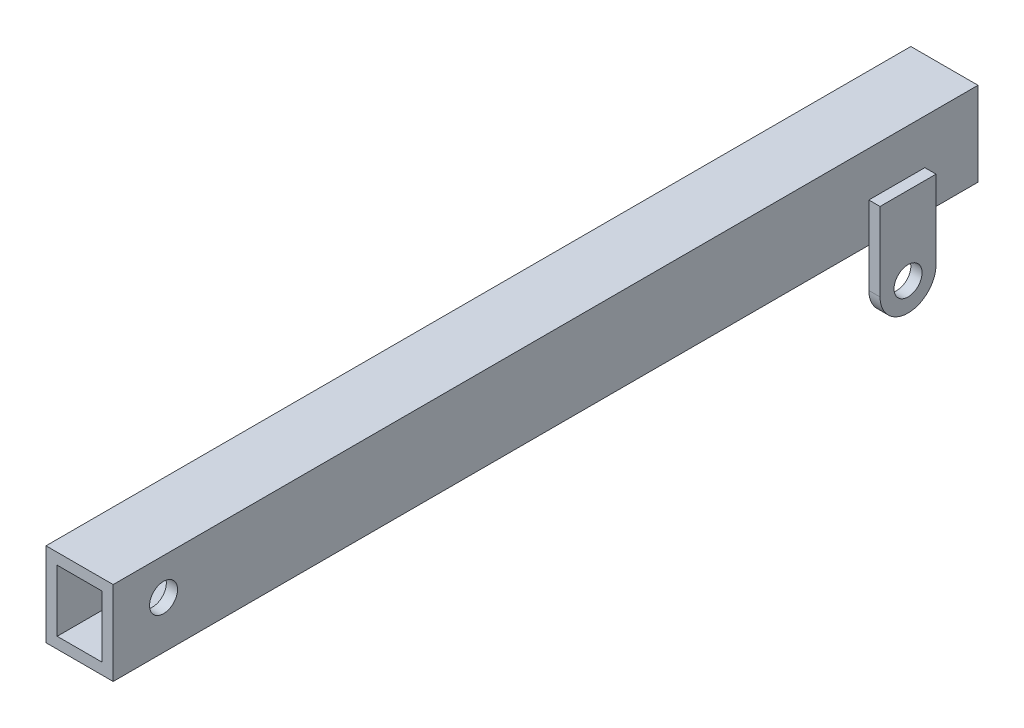
ISO-10303-21;
HEADER;
FILE_DESCRIPTION(('STEP AP214'),'2;1');
FILE_NAME('part.step','',(''),(''),'','','');
FILE_SCHEMA(('AUTOMOTIVE_DESIGN { 1 0 10303 214 1 1 1 1 }'));
ENDSEC;
DATA;
#1=APPLICATION_CONTEXT('core data for automotive mechanical design processes');
#2=APPLICATION_PROTOCOL_DEFINITION('international standard','automotive_design',2000,#1);
#3=PRODUCT_CONTEXT('',#1,'mechanical');
#4=PRODUCT('Part','Part','',(#3));
#5=PRODUCT_RELATED_PRODUCT_CATEGORY('part','',(#4));
#6=PRODUCT_DEFINITION_FORMATION('','',#4);
#7=PRODUCT_DEFINITION_CONTEXT('part definition',#1,'design');
#8=PRODUCT_DEFINITION('design','',#6,#7);
#9=PRODUCT_DEFINITION_SHAPE('','',#8);
#10=(LENGTH_UNIT() NAMED_UNIT(*) SI_UNIT(.MILLI.,.METRE.));
#11=(NAMED_UNIT(*) PLANE_ANGLE_UNIT() SI_UNIT($,.RADIAN.));
#12=(NAMED_UNIT(*) SI_UNIT($,.STERADIAN.) SOLID_ANGLE_UNIT());
#13=UNCERTAINTY_MEASURE_WITH_UNIT(LENGTH_MEASURE(1.E-05),#10,'distance_accuracy_value','');
#14=(GEOMETRIC_REPRESENTATION_CONTEXT(3) GLOBAL_UNCERTAINTY_ASSIGNED_CONTEXT((#13)) GLOBAL_UNIT_ASSIGNED_CONTEXT((#10,
#11,#12)) REPRESENTATION_CONTEXT('',''));
#15=CARTESIAN_POINT('',(0.,0.,0.));
#16=DIRECTION('',(0.,0.,1.));
#17=DIRECTION('',(1.,0.,0.));
#18=AXIS2_PLACEMENT_3D('',#15,#16,#17);
#19=CARTESIAN_POINT('',(-6.,-7.5,159.5));
#20=DIRECTION('',(1.,0.,0.));
#21=DIRECTION('',(0.,0.,-1.));
#22=AXIS2_PLACEMENT_3D('',#19,#20,#21);
#23=PLANE('',#22);
#24=CARTESIAN_POINT('',(-6.,0.999999999999758,-9.0000000000012));
#25=DIRECTION('',(-1.,0.,0.));
#26=DIRECTION('',(0.,0.,1.));
#27=AXIS2_PLACEMENT_3D('',#24,#25,#26);
#28=CIRCLE('',#27,2.5);
#29=CARTESIAN_POINT('',(-6.,0.999999999999758,-6.5000000000012));
#30=VERTEX_POINT('',#29);
#31=EDGE_CURVE('E198',#30,#30,#28,.T.);
#32=ORIENTED_EDGE('',*,*,#31,.F.);
#33=EDGE_LOOP('',(#32));
#34=FACE_BOUND('',#33,.T.);
#35=DIRECTION('',(0.,0.,-1.));
#36=VECTOR('',#35,1.);
#37=CARTESIAN_POINT('',(-6.,7.5,159.5));
#38=LINE('',#37,#36);
#39=CARTESIAN_POINT('',(-6.,7.5,0.));
#40=VERTEX_POINT('',#39);
#41=CARTESIAN_POINT('',(-6.,7.5,-154.5));
#42=VERTEX_POINT('',#41);
#43=EDGE_CURVE('E186',#40,#42,#38,.T.);
#44=ORIENTED_EDGE('',*,*,#43,.T.);
#45=DIRECTION('',(0.,-1.,0.));
#46=VECTOR('',#45,1.);
#47=CARTESIAN_POINT('',(-6.,-7.5,-154.5));
#48=LINE('',#47,#46);
#49=CARTESIAN_POINT('',(-6.,-7.5,-154.5));
#50=VERTEX_POINT('',#49);
#51=EDGE_CURVE('E164',#42,#50,#48,.T.);
#52=ORIENTED_EDGE('',*,*,#51,.T.);
#53=DIRECTION('',(0.,0.,-1.));
#54=VECTOR('',#53,1.);
#55=CARTESIAN_POINT('',(-6.,-7.5,159.5));
#56=LINE('',#55,#54);
#57=CARTESIAN_POINT('',(-6.,-7.5,-145.));
#58=VERTEX_POINT('',#57);
#59=EDGE_CURVE('E363',#58,#50,#56,.T.);
#60=ORIENTED_EDGE('',*,*,#59,.F.);
#61=DIRECTION('',(0.,-1.,0.));
#62=VECTOR('',#61,1.);
#63=CARTESIAN_POINT('',(-6.,-14.5,-145.));
#64=LINE('',#63,#62);
#65=CARTESIAN_POINT('',(-6.,-0.500000000000001,-145.));
#66=VERTEX_POINT('',#65);
#67=EDGE_CURVE('E325',#66,#58,#64,.T.);
#68=ORIENTED_EDGE('',*,*,#67,.F.);
#69=DIRECTION('',(0.,0.,-1.));
#70=VECTOR('',#69,1.);
#71=CARTESIAN_POINT('',(-6.,-0.500000000000001,-145.));
#72=LINE('',#71,#70);
#73=CARTESIAN_POINT('',(-6.,-0.500000000000001,-135.));
#74=VERTEX_POINT('',#73);
#75=EDGE_CURVE('E321',#74,#66,#72,.T.);
#76=ORIENTED_EDGE('',*,*,#75,.F.);
#77=DIRECTION('',(0.,1.,0.));
#78=VECTOR('',#77,1.);
#79=CARTESIAN_POINT('',(-6.,-14.5,-135.));
#80=LINE('',#79,#78);
#81=CARTESIAN_POINT('',(-6.,-7.5,-135.));
#82=VERTEX_POINT('',#81);
#83=EDGE_CURVE('E298',#82,#74,#80,.T.);
#84=ORIENTED_EDGE('',*,*,#83,.F.);
#85=CARTESIAN_POINT('',(-6.,-7.5,0.));
#86=VERTEX_POINT('',#85);
#87=EDGE_CURVE('E191',#86,#82,#56,.T.);
#88=ORIENTED_EDGE('',*,*,#87,.F.);
#89=DIRECTION('',(0.,1.,0.));
#90=VECTOR('',#89,1.);
#91=CARTESIAN_POINT('',(-6.,-7.5,0.));
#92=LINE('',#91,#90);
#93=EDGE_CURVE('E234',#86,#40,#92,.T.);
#94=ORIENTED_EDGE('',*,*,#93,.T.);
#95=EDGE_LOOP('',(#44,#52,#60,#68,#76,#84,#88,#94));
#96=FACE_BOUND('',#95,.T.);
#97=ADVANCED_FACE('F38',(#34,#96),#23,.F.);
#98=CARTESIAN_POINT('',(6.,-7.5,159.5));
#99=DIRECTION('',(-1.,0.,0.));
#100=DIRECTION('',(0.,0.,1.));
#101=AXIS2_PLACEMENT_3D('',#98,#99,#100);
#102=PLANE('',#101);
#103=CARTESIAN_POINT('',(6.,0.999999999999758,-9.0000000000012));
#104=DIRECTION('',(-1.,0.,0.));
#105=DIRECTION('',(0.,0.,1.));
#106=AXIS2_PLACEMENT_3D('',#103,#104,#105);
#107=CIRCLE('',#106,2.5);
#108=CARTESIAN_POINT('',(6.,0.999999999999758,-6.5000000000012));
#109=VERTEX_POINT('',#108);
#110=EDGE_CURVE('E204',#109,#109,#107,.T.);
#111=ORIENTED_EDGE('',*,*,#110,.T.);
#112=EDGE_LOOP('',(#111));
#113=FACE_BOUND('',#112,.T.);
#114=DIRECTION('',(0.,0.,-1.));
#115=VECTOR('',#114,1.);
#116=CARTESIAN_POINT('',(6.,-7.5,159.5));
#117=LINE('',#116,#115);
#118=CARTESIAN_POINT('',(6.,-7.5,-145.));
#119=VERTEX_POINT('',#118);
#120=CARTESIAN_POINT('',(6.,-7.5,-154.5));
#121=VERTEX_POINT('',#120);
#122=EDGE_CURVE('E178',#119,#121,#117,.T.);
#123=ORIENTED_EDGE('',*,*,#122,.T.);
#124=DIRECTION('',(0.,1.,0.));
#125=VECTOR('',#124,1.);
#126=CARTESIAN_POINT('',(6.,-7.5,-154.5));
#127=LINE('',#126,#125);
#128=CARTESIAN_POINT('',(6.,7.5,-154.5));
#129=VERTEX_POINT('',#128);
#130=EDGE_CURVE('E54',#121,#129,#127,.T.);
#131=ORIENTED_EDGE('',*,*,#130,.T.);
#132=DIRECTION('',(0.,0.,-1.));
#133=VECTOR('',#132,1.);
#134=CARTESIAN_POINT('',(6.,7.5,159.5));
#135=LINE('',#134,#133);
#136=CARTESIAN_POINT('',(6.,7.5,0.));
#137=VERTEX_POINT('',#136);
#138=EDGE_CURVE('E176',#137,#129,#135,.T.);
#139=ORIENTED_EDGE('',*,*,#138,.F.);
#140=DIRECTION('',(0.,-1.,0.));
#141=VECTOR('',#140,1.);
#142=CARTESIAN_POINT('',(6.,-7.5,0.));
#143=LINE('',#142,#141);
#144=CARTESIAN_POINT('',(6.,-7.5,0.));
#145=VERTEX_POINT('',#144);
#146=EDGE_CURVE('E231',#137,#145,#143,.T.);
#147=ORIENTED_EDGE('',*,*,#146,.T.);
#148=CARTESIAN_POINT('',(6.,-7.5,-135.));
#149=VERTEX_POINT('',#148);
#150=EDGE_CURVE('E361',#145,#149,#117,.T.);
#151=ORIENTED_EDGE('',*,*,#150,.T.);
#152=DIRECTION('',(0.,1.,0.));
#153=VECTOR('',#152,1.);
#154=CARTESIAN_POINT('',(6.,-14.5,-135.));
#155=LINE('',#154,#153);
#156=CARTESIAN_POINT('',(6.,-0.5,-135.));
#157=VERTEX_POINT('',#156);
#158=EDGE_CURVE('E243',#149,#157,#155,.T.);
#159=ORIENTED_EDGE('',*,*,#158,.T.);
#160=DIRECTION('',(0.,0.,-1.));
#161=VECTOR('',#160,1.);
#162=CARTESIAN_POINT('',(6.,-0.500000000000001,-145.));
#163=LINE('',#162,#161);
#164=CARTESIAN_POINT('',(6.,-0.5,-145.));
#165=VERTEX_POINT('',#164);
#166=EDGE_CURVE('E252',#157,#165,#163,.T.);
#167=ORIENTED_EDGE('',*,*,#166,.T.);
#168=DIRECTION('',(0.,-1.,0.));
#169=VECTOR('',#168,1.);
#170=CARTESIAN_POINT('',(6.,-14.5,-145.));
#171=LINE('',#170,#169);
#172=EDGE_CURVE('E274',#165,#119,#171,.T.);
#173=ORIENTED_EDGE('',*,*,#172,.T.);
#174=EDGE_LOOP('',(#123,#131,#139,#147,#151,#159,#167,#173));
#175=FACE_BOUND('',#174,.T.);
#176=ADVANCED_FACE('F40',(#113,#175),#102,.F.);
#177=CARTESIAN_POINT('',(-6.,7.5,159.5));
#178=DIRECTION('',(0.,-1.,0.));
#179=DIRECTION('',(0.,0.,-1.));
#180=AXIS2_PLACEMENT_3D('',#177,#178,#179);
#181=PLANE('',#180);
#182=ORIENTED_EDGE('',*,*,#138,.T.);
#183=DIRECTION('',(-1.,0.,0.));
#184=VECTOR('',#183,1.);
#185=CARTESIAN_POINT('',(8.,7.5,-154.5));
#186=LINE('',#185,#184);
#187=EDGE_CURVE('E161',#129,#42,#186,.T.);
#188=ORIENTED_EDGE('',*,*,#187,.T.);
#189=ORIENTED_EDGE('',*,*,#43,.F.);
#190=DIRECTION('',(1.,0.,0.));
#191=VECTOR('',#190,1.);
#192=CARTESIAN_POINT('',(-8.,7.5,0.));
#193=LINE('',#192,#191);
#194=EDGE_CURVE('E184',#40,#137,#193,.T.);
#195=ORIENTED_EDGE('',*,*,#194,.T.);
#196=EDGE_LOOP('',(#182,#188,#189,#195));
#197=FACE_BOUND('',#196,.T.);
#198=ADVANCED_FACE('F183',(#197),#181,.F.);
#199=CARTESIAN_POINT('',(-6.,-7.5,159.5));
#200=DIRECTION('',(0.,1.,0.));
#201=DIRECTION('',(0.,0.,1.));
#202=AXIS2_PLACEMENT_3D('',#199,#200,#201);
#203=PLANE('',#202);
#204=ORIENTED_EDGE('',*,*,#59,.T.);
#205=DIRECTION('',(-1.,0.,0.));
#206=VECTOR('',#205,1.);
#207=CARTESIAN_POINT('',(8.,-7.5,-154.5));
#208=LINE('',#207,#206);
#209=EDGE_CURVE('E170',#121,#50,#208,.T.);
#210=ORIENTED_EDGE('',*,*,#209,.F.);
#211=ORIENTED_EDGE('',*,*,#122,.F.);
#212=EDGE_CURVE('E364',#149,#119,#117,.T.);
#213=ORIENTED_EDGE('',*,*,#212,.F.);
#214=ORIENTED_EDGE('',*,*,#150,.F.);
#215=DIRECTION('',(-1.,0.,0.));
#216=VECTOR('',#215,1.);
#217=CARTESIAN_POINT('',(-6.,-7.5,0.));
#218=LINE('',#217,#216);
#219=EDGE_CURVE('E227',#145,#86,#218,.T.);
#220=ORIENTED_EDGE('',*,*,#219,.T.);
#221=ORIENTED_EDGE('',*,*,#87,.T.);
#222=EDGE_CURVE('E366',#82,#58,#56,.T.);
#223=ORIENTED_EDGE('',*,*,#222,.T.);
#224=EDGE_LOOP('',(#204,#210,#211,#213,#214,#220,#221,#223));
#225=FACE_BOUND('',#224,.T.);
#226=ADVANCED_FACE('F375',(#225),#203,.F.);
#227=CARTESIAN_POINT('',(4.,-5.5,159.5));
#228=DIRECTION('',(-1.,0.,0.));
#229=DIRECTION('',(0.,0.,1.));
#230=AXIS2_PLACEMENT_3D('',#227,#228,#229);
#231=PLANE('',#230);
#232=DIRECTION('',(0.,1.,0.));
#233=VECTOR('',#232,1.);
#234=CARTESIAN_POINT('',(4.,-5.5,-154.5));
#235=LINE('',#234,#233);
#236=CARTESIAN_POINT('',(4.,-5.5,-154.5));
#237=VERTEX_POINT('',#236);
#238=CARTESIAN_POINT('',(4.,5.5,-154.5));
#239=VERTEX_POINT('',#238);
#240=EDGE_CURVE('E180',#237,#239,#235,.T.);
#241=ORIENTED_EDGE('',*,*,#240,.F.);
#242=DIRECTION('',(0.,0.,-1.));
#243=VECTOR('',#242,1.);
#244=CARTESIAN_POINT('',(4.,-5.5,159.5));
#245=LINE('',#244,#243);
#246=CARTESIAN_POINT('',(4.,-5.5,0.));
#247=VERTEX_POINT('',#246);
#248=EDGE_CURVE('E345',#247,#237,#245,.T.);
#249=ORIENTED_EDGE('',*,*,#248,.F.);
#250=DIRECTION('',(0.,-1.,0.));
#251=VECTOR('',#250,1.);
#252=CARTESIAN_POINT('',(4.,-5.5,0.));
#253=LINE('',#252,#251);
#254=CARTESIAN_POINT('',(4.,5.5,0.));
#255=VERTEX_POINT('',#254);
#256=EDGE_CURVE('E224',#255,#247,#253,.T.);
#257=ORIENTED_EDGE('',*,*,#256,.F.);
#258=DIRECTION('',(0.,0.,-1.));
#259=VECTOR('',#258,1.);
#260=CARTESIAN_POINT('',(4.,5.5,159.5));
#261=LINE('',#260,#259);
#262=EDGE_CURVE('E357',#255,#239,#261,.T.);
#263=ORIENTED_EDGE('',*,*,#262,.T.);
#264=EDGE_LOOP('',(#241,#249,#257,#263));
#265=FACE_BOUND('',#264,.T.);
#266=CARTESIAN_POINT('',(4.,0.999999999999758,-9.0000000000012));
#267=DIRECTION('',(-1.,0.,0.));
#268=DIRECTION('',(0.,0.,1.));
#269=AXIS2_PLACEMENT_3D('',#266,#267,#268);
#270=CIRCLE('',#269,2.5);
#271=CARTESIAN_POINT('',(4.,0.999999999999758,-6.5000000000012));
#272=VERTEX_POINT('',#271);
#273=EDGE_CURVE('E197',#272,#272,#270,.T.);
#274=ORIENTED_EDGE('',*,*,#273,.F.);
#275=EDGE_LOOP('',(#274));
#276=FACE_BOUND('',#275,.T.);
#277=ADVANCED_FACE('F455',(#265,#276),#231,.T.);
#278=CARTESIAN_POINT('',(-4.,5.5,159.5));
#279=DIRECTION('',(0.,-1.,0.));
#280=DIRECTION('',(0.,0.,-1.));
#281=AXIS2_PLACEMENT_3D('',#278,#279,#280);
#282=PLANE('',#281);
#283=DIRECTION('',(-1.,0.,0.));
#284=VECTOR('',#283,1.);
#285=CARTESIAN_POINT('',(-4.,5.5,-154.5));
#286=LINE('',#285,#284);
#287=CARTESIAN_POINT('',(-4.,5.5,-154.5));
#288=VERTEX_POINT('',#287);
#289=EDGE_CURVE('E664',#239,#288,#286,.T.);
#290=ORIENTED_EDGE('',*,*,#289,.F.);
#291=ORIENTED_EDGE('',*,*,#262,.F.);
#292=DIRECTION('',(1.,0.,0.));
#293=VECTOR('',#292,1.);
#294=CARTESIAN_POINT('',(-4.,5.5,0.));
#295=LINE('',#294,#293);
#296=CARTESIAN_POINT('',(-4.,5.5,0.));
#297=VERTEX_POINT('',#296);
#298=EDGE_CURVE('E221',#297,#255,#295,.T.);
#299=ORIENTED_EDGE('',*,*,#298,.F.);
#300=DIRECTION('',(0.,0.,-1.));
#301=VECTOR('',#300,1.);
#302=CARTESIAN_POINT('',(-4.,5.5,159.5));
#303=LINE('',#302,#301);
#304=EDGE_CURVE('E353',#297,#288,#303,.T.);
#305=ORIENTED_EDGE('',*,*,#304,.T.);
#306=EDGE_LOOP('',(#290,#291,#299,#305));
#307=FACE_BOUND('',#306,.T.);
#308=ADVANCED_FACE('F459',(#307),#282,.T.);
#309=CARTESIAN_POINT('',(-4.,-5.5,159.5));
#310=DIRECTION('',(1.,0.,0.));
#311=DIRECTION('',(0.,0.,-1.));
#312=AXIS2_PLACEMENT_3D('',#309,#310,#311);
#313=PLANE('',#312);
#314=DIRECTION('',(0.,-1.,0.));
#315=VECTOR('',#314,1.);
#316=CARTESIAN_POINT('',(-4.,-5.5,-154.5));
#317=LINE('',#316,#315);
#318=CARTESIAN_POINT('',(-4.,-5.5,-154.5));
#319=VERTEX_POINT('',#318);
#320=EDGE_CURVE('E61',#288,#319,#317,.T.);
#321=ORIENTED_EDGE('',*,*,#320,.F.);
#322=ORIENTED_EDGE('',*,*,#304,.F.);
#323=DIRECTION('',(0.,1.,0.));
#324=VECTOR('',#323,1.);
#325=CARTESIAN_POINT('',(-4.,-5.5,0.));
#326=LINE('',#325,#324);
#327=CARTESIAN_POINT('',(-4.,-5.5,0.));
#328=VERTEX_POINT('',#327);
#329=EDGE_CURVE('E218',#328,#297,#326,.T.);
#330=ORIENTED_EDGE('',*,*,#329,.F.);
#331=DIRECTION('',(0.,0.,-1.));
#332=VECTOR('',#331,1.);
#333=CARTESIAN_POINT('',(-4.,-5.5,159.5));
#334=LINE('',#333,#332);
#335=EDGE_CURVE('E349',#328,#319,#334,.T.);
#336=ORIENTED_EDGE('',*,*,#335,.T.);
#337=EDGE_LOOP('',(#321,#322,#330,#336));
#338=FACE_BOUND('',#337,.T.);
#339=CARTESIAN_POINT('',(-4.,0.999999999999758,-9.0000000000012));
#340=DIRECTION('',(1.,0.,0.));
#341=DIRECTION('',(0.,0.,-1.));
#342=AXIS2_PLACEMENT_3D('',#339,#340,#341);
#343=CIRCLE('',#342,2.5);
#344=CARTESIAN_POINT('',(-4.,0.999999999999758,-11.5000000000012));
#345=VERTEX_POINT('',#344);
#346=EDGE_CURVE('E194',#345,#345,#343,.T.);
#347=ORIENTED_EDGE('',*,*,#346,.F.);
#348=EDGE_LOOP('',(#347));
#349=FACE_BOUND('',#348,.T.);
#350=ADVANCED_FACE('F464',(#338,#349),#313,.T.);
#351=CARTESIAN_POINT('',(-4.,-5.5,159.5));
#352=DIRECTION('',(0.,1.,0.));
#353=DIRECTION('',(0.,0.,1.));
#354=AXIS2_PLACEMENT_3D('',#351,#352,#353);
#355=PLANE('',#354);
#356=DIRECTION('',(1.,0.,0.));
#357=VECTOR('',#356,1.);
#358=CARTESIAN_POINT('',(-4.,-5.5,-154.5));
#359=LINE('',#358,#357);
#360=EDGE_CURVE('E11',#319,#237,#359,.T.);
#361=ORIENTED_EDGE('',*,*,#360,.F.);
#362=ORIENTED_EDGE('',*,*,#335,.F.);
#363=DIRECTION('',(-1.,0.,0.));
#364=VECTOR('',#363,1.);
#365=CARTESIAN_POINT('',(-4.,-5.5,0.));
#366=LINE('',#365,#364);
#367=EDGE_CURVE('E47',#247,#328,#366,.T.);
#368=ORIENTED_EDGE('',*,*,#367,.F.);
#369=ORIENTED_EDGE('',*,*,#248,.T.);
#370=EDGE_LOOP('',(#361,#362,#368,#369));
#371=FACE_BOUND('',#370,.T.);
#372=ADVANCED_FACE('F472',(#371),#355,.T.);
#373=CARTESIAN_POINT('',(-6.,-14.5,-140.));
#374=DIRECTION('',(-1.,0.,0.));
#375=DIRECTION('',(0.,0.,1.));
#376=AXIS2_PLACEMENT_3D('',#373,#374,#375);
#377=PLANE('',#376);
#378=CARTESIAN_POINT('',(-6.,-14.5,-140.));
#379=DIRECTION('',(-1.,0.,0.));
#380=DIRECTION('',(0.,0.,1.));
#381=AXIS2_PLACEMENT_3D('',#378,#379,#380);
#382=CIRCLE('',#381,2.5);
#383=CARTESIAN_POINT('',(-6.,-14.5,-137.5));
#384=VERTEX_POINT('',#383);
#385=EDGE_CURVE('E293',#384,#384,#382,.T.);
#386=ORIENTED_EDGE('',*,*,#385,.T.);
#387=EDGE_LOOP('',(#386));
#388=FACE_BOUND('',#387,.T.);
#389=CARTESIAN_POINT('',(-6.,-14.5,-145.));
#390=VERTEX_POINT('',#389);
#391=EDGE_CURVE('E324',#58,#390,#64,.T.);
#392=ORIENTED_EDGE('',*,*,#391,.F.);
#393=ORIENTED_EDGE('',*,*,#222,.F.);
#394=CARTESIAN_POINT('',(-6.,-14.5,-135.));
#395=VERTEX_POINT('',#394);
#396=EDGE_CURVE('E317',#395,#82,#80,.T.);
#397=ORIENTED_EDGE('',*,*,#396,.F.);
#398=CARTESIAN_POINT('',(-6.,-14.5,-140.));
#399=DIRECTION('',(-1.,0.,0.));
#400=DIRECTION('',(0.,0.,1.));
#401=AXIS2_PLACEMENT_3D('',#398,#399,#400);
#402=CIRCLE('',#401,5.);
#403=EDGE_CURVE('E307',#390,#395,#402,.T.);
#404=ORIENTED_EDGE('',*,*,#403,.F.);
#405=EDGE_LOOP('',(#392,#393,#397,#404));
#406=FACE_BOUND('',#405,.T.);
#407=ADVANCED_FACE('F425',(#388,#406),#377,.F.);
#408=CARTESIAN_POINT('',(-8.,-14.5,-140.));
#409=DIRECTION('',(-1.,0.,0.));
#410=DIRECTION('',(0.,0.,1.));
#411=AXIS2_PLACEMENT_3D('',#408,#409,#410);
#412=PLANE('',#411);
#413=DIRECTION('',(0.,1.,0.));
#414=VECTOR('',#413,1.);
#415=CARTESIAN_POINT('',(-8.,-14.5,-135.));
#416=LINE('',#415,#414);
#417=CARTESIAN_POINT('',(-8.,-14.5,-135.));
#418=VERTEX_POINT('',#417);
#419=CARTESIAN_POINT('',(-8.,-0.500000000000001,-135.));
#420=VERTEX_POINT('',#419);
#421=EDGE_CURVE('E302',#418,#420,#416,.T.);
#422=ORIENTED_EDGE('',*,*,#421,.T.);
#423=DIRECTION('',(0.,0.,-1.));
#424=VECTOR('',#423,1.);
#425=CARTESIAN_POINT('',(-8.,-0.500000000000001,-145.));
#426=LINE('',#425,#424);
#427=CARTESIAN_POINT('',(-8.,-0.500000000000001,-145.));
#428=VERTEX_POINT('',#427);
#429=EDGE_CURVE('E306',#420,#428,#426,.T.);
#430=ORIENTED_EDGE('',*,*,#429,.T.);
#431=DIRECTION('',(0.,-1.,0.));
#432=VECTOR('',#431,1.);
#433=CARTESIAN_POINT('',(-8.,-14.5,-145.));
#434=LINE('',#433,#432);
#435=CARTESIAN_POINT('',(-8.,-14.5,-145.));
#436=VERTEX_POINT('',#435);
#437=EDGE_CURVE('E310',#428,#436,#434,.T.);
#438=ORIENTED_EDGE('',*,*,#437,.T.);
#439=CARTESIAN_POINT('',(-8.,-14.5,-140.));
#440=DIRECTION('',(-1.,0.,0.));
#441=DIRECTION('',(0.,0.,1.));
#442=AXIS2_PLACEMENT_3D('',#439,#440,#441);
#443=CIRCLE('',#442,5.);
#444=EDGE_CURVE('E313',#436,#418,#443,.T.);
#445=ORIENTED_EDGE('',*,*,#444,.T.);
#446=EDGE_LOOP('',(#422,#430,#438,#445));
#447=FACE_BOUND('',#446,.T.);
#448=CARTESIAN_POINT('',(-8.,-14.5,-140.));
#449=DIRECTION('',(-1.,0.,0.));
#450=DIRECTION('',(0.,0.,1.));
#451=AXIS2_PLACEMENT_3D('',#448,#449,#450);
#452=CIRCLE('',#451,2.5);
#453=CARTESIAN_POINT('',(-8.,-14.5,-137.5));
#454=VERTEX_POINT('',#453);
#455=EDGE_CURVE('E294',#454,#454,#452,.T.);
#456=ORIENTED_EDGE('',*,*,#455,.F.);
#457=EDGE_LOOP('',(#456));
#458=FACE_BOUND('',#457,.T.);
#459=ADVANCED_FACE('F417',(#447,#458),#412,.T.);
#460=CARTESIAN_POINT('',(-8.,-14.5,-135.));
#461=DIRECTION('',(0.,0.,-1.));
#462=DIRECTION('',(-1.,0.,0.));
#463=AXIS2_PLACEMENT_3D('',#460,#461,#462);
#464=PLANE('',#463);
#465=ORIENTED_EDGE('',*,*,#396,.T.);
#466=ORIENTED_EDGE('',*,*,#83,.T.);
#467=DIRECTION('',(1.,0.,0.));
#468=VECTOR('',#467,1.);
#469=CARTESIAN_POINT('',(-8.,-0.500000000000001,-135.));
#470=LINE('',#469,#468);
#471=EDGE_CURVE('E341',#420,#74,#470,.T.);
#472=ORIENTED_EDGE('',*,*,#471,.F.);
#473=ORIENTED_EDGE('',*,*,#421,.F.);
#474=DIRECTION('',(1.,0.,0.));
#475=VECTOR('',#474,1.);
#476=CARTESIAN_POINT('',(-8.,-14.5,-135.));
#477=LINE('',#476,#475);
#478=EDGE_CURVE('E316',#418,#395,#477,.T.);
#479=ORIENTED_EDGE('',*,*,#478,.T.);
#480=EDGE_LOOP('',(#465,#466,#472,#473,#479));
#481=FACE_BOUND('',#480,.T.);
#482=ADVANCED_FACE('F409',(#481),#464,.F.);
#483=CARTESIAN_POINT('',(-8.,-0.500000000000001,-145.));
#484=DIRECTION('',(0.,-1.,0.));
#485=DIRECTION('',(0.,0.,-1.));
#486=AXIS2_PLACEMENT_3D('',#483,#484,#485);
#487=PLANE('',#486);
#488=ORIENTED_EDGE('',*,*,#75,.T.);
#489=DIRECTION('',(1.,0.,0.));
#490=VECTOR('',#489,1.);
#491=CARTESIAN_POINT('',(-8.,-0.500000000000001,-145.));
#492=LINE('',#491,#490);
#493=EDGE_CURVE('E337',#428,#66,#492,.T.);
#494=ORIENTED_EDGE('',*,*,#493,.F.);
#495=ORIENTED_EDGE('',*,*,#429,.F.);
#496=ORIENTED_EDGE('',*,*,#471,.T.);
#497=EDGE_LOOP('',(#488,#494,#495,#496));
#498=FACE_BOUND('',#497,.T.);
#499=ADVANCED_FACE('F413',(#498),#487,.F.);
#500=CARTESIAN_POINT('',(-8.,-14.5,-145.));
#501=DIRECTION('',(0.,0.,1.));
#502=DIRECTION('',(1.,0.,0.));
#503=AXIS2_PLACEMENT_3D('',#500,#501,#502);
#504=PLANE('',#503);
#505=ORIENTED_EDGE('',*,*,#67,.T.);
#506=ORIENTED_EDGE('',*,*,#391,.T.);
#507=DIRECTION('',(1.,0.,0.));
#508=VECTOR('',#507,1.);
#509=CARTESIAN_POINT('',(-8.,-14.5,-145.));
#510=LINE('',#509,#508);
#511=EDGE_CURVE('E333',#436,#390,#510,.T.);
#512=ORIENTED_EDGE('',*,*,#511,.F.);
#513=ORIENTED_EDGE('',*,*,#437,.F.);
#514=ORIENTED_EDGE('',*,*,#493,.T.);
#515=EDGE_LOOP('',(#505,#506,#512,#513,#514));
#516=FACE_BOUND('',#515,.T.);
#517=ADVANCED_FACE('F428',(#516),#504,.F.);
#518=CARTESIAN_POINT('',(-8.,-14.5,-140.));
#519=DIRECTION('',(1.,0.,0.));
#520=DIRECTION('',(0.,0.,-1.));
#521=AXIS2_PLACEMENT_3D('',#518,#519,#520);
#522=CYLINDRICAL_SURFACE('',#521,5.);
#523=ORIENTED_EDGE('',*,*,#403,.T.);
#524=ORIENTED_EDGE('',*,*,#478,.F.);
#525=ORIENTED_EDGE('',*,*,#444,.F.);
#526=ORIENTED_EDGE('',*,*,#511,.T.);
#527=EDGE_LOOP('',(#523,#524,#525,#526));
#528=FACE_BOUND('',#527,.T.);
#529=ADVANCED_FACE('F429',(#528),#522,.T.);
#530=CARTESIAN_POINT('',(-8.,-14.5,-140.));
#531=DIRECTION('',(1.,0.,0.));
#532=DIRECTION('',(0.,0.,-1.));
#533=AXIS2_PLACEMENT_3D('',#530,#531,#532);
#534=CYLINDRICAL_SURFACE('',#533,2.5);
#535=ORIENTED_EDGE('',*,*,#455,.T.);
#536=EDGE_LOOP('',(#535));
#537=FACE_BOUND('',#536,.T.);
#538=ORIENTED_EDGE('',*,*,#385,.F.);
#539=EDGE_LOOP('',(#538));
#540=FACE_BOUND('',#539,.T.);
#541=ADVANCED_FACE('F431',(#537,#540),#534,.F.);
#542=CARTESIAN_POINT('',(6.,-14.5,-140.));
#543=DIRECTION('',(1.,0.,0.));
#544=DIRECTION('',(0.,0.,1.));
#545=AXIS2_PLACEMENT_3D('',#542,#543,#544);
#546=PLANE('',#545);
#547=CARTESIAN_POINT('',(6.,-14.5,-140.));
#548=DIRECTION('',(-1.,0.,0.));
#549=DIRECTION('',(0.,0.,1.));
#550=AXIS2_PLACEMENT_3D('',#547,#548,#549);
#551=CIRCLE('',#550,2.5);
#552=CARTESIAN_POINT('',(6.,-14.5,-137.5));
#553=VERTEX_POINT('',#552);
#554=EDGE_CURVE('E238',#553,#553,#551,.T.);
#555=ORIENTED_EDGE('',*,*,#554,.F.);
#556=EDGE_LOOP('',(#555));
#557=FACE_BOUND('',#556,.T.);
#558=CARTESIAN_POINT('',(6.,-14.5,-135.));
#559=VERTEX_POINT('',#558);
#560=EDGE_CURVE('E265',#559,#149,#155,.T.);
#561=ORIENTED_EDGE('',*,*,#560,.T.);
#562=ORIENTED_EDGE('',*,*,#212,.T.);
#563=CARTESIAN_POINT('',(6.,-14.5,-145.));
#564=VERTEX_POINT('',#563);
#565=EDGE_CURVE('E273',#119,#564,#171,.T.);
#566=ORIENTED_EDGE('',*,*,#565,.T.);
#567=CARTESIAN_POINT('',(6.,-14.5,-140.));
#568=DIRECTION('',(-1.,0.,0.));
#569=DIRECTION('',(0.,0.,1.));
#570=AXIS2_PLACEMENT_3D('',#567,#568,#569);
#571=CIRCLE('',#570,5.);
#572=EDGE_CURVE('E269',#564,#559,#571,.T.);
#573=ORIENTED_EDGE('',*,*,#572,.T.);
#574=EDGE_LOOP('',(#561,#562,#566,#573));
#575=FACE_BOUND('',#574,.T.);
#576=ADVANCED_FACE('F401',(#557,#575),#546,.F.);
#577=CARTESIAN_POINT('',(8.,-14.5,-135.));
#578=DIRECTION('',(0.,0.,1.));
#579=DIRECTION('',(1.,0.,0.));
#580=AXIS2_PLACEMENT_3D('',#577,#578,#579);
#581=PLANE('',#580);
#582=ORIENTED_EDGE('',*,*,#560,.F.);
#583=DIRECTION('',(-1.,0.,0.));
#584=VECTOR('',#583,1.);
#585=CARTESIAN_POINT('',(8.,-14.5,-135.));
#586=LINE('',#585,#584);
#587=CARTESIAN_POINT('',(8.,-14.5,-135.));
#588=VERTEX_POINT('',#587);
#589=EDGE_CURVE('E290',#588,#559,#586,.T.);
#590=ORIENTED_EDGE('',*,*,#589,.F.);
#591=DIRECTION('',(0.,1.,0.));
#592=VECTOR('',#591,1.);
#593=CARTESIAN_POINT('',(8.,-14.5,-135.));
#594=LINE('',#593,#592);
#595=CARTESIAN_POINT('',(8.,-0.500000000000001,-135.));
#596=VERTEX_POINT('',#595);
#597=EDGE_CURVE('E247',#588,#596,#594,.T.);
#598=ORIENTED_EDGE('',*,*,#597,.T.);
#599=DIRECTION('',(-1.,0.,0.));
#600=VECTOR('',#599,1.);
#601=CARTESIAN_POINT('',(8.,-0.500000000000001,-135.));
#602=LINE('',#601,#600);
#603=EDGE_CURVE('E264',#596,#157,#602,.T.);
#604=ORIENTED_EDGE('',*,*,#603,.T.);
#605=ORIENTED_EDGE('',*,*,#158,.F.);
#606=EDGE_LOOP('',(#582,#590,#598,#604,#605));
#607=FACE_BOUND('',#606,.T.);
#608=ADVANCED_FACE('F390',(#607),#581,.T.);
#609=CARTESIAN_POINT('',(8.,-14.5,-140.));
#610=DIRECTION('',(-1.,0.,0.));
#611=DIRECTION('',(0.,0.,1.));
#612=AXIS2_PLACEMENT_3D('',#609,#610,#611);
#613=CYLINDRICAL_SURFACE('',#612,5.);
#614=ORIENTED_EDGE('',*,*,#572,.F.);
#615=DIRECTION('',(-1.,0.,0.));
#616=VECTOR('',#615,1.);
#617=CARTESIAN_POINT('',(8.,-14.5,-145.));
#618=LINE('',#617,#616);
#619=CARTESIAN_POINT('',(8.,-14.5,-145.));
#620=VERTEX_POINT('',#619);
#621=EDGE_CURVE('E286',#620,#564,#618,.T.);
#622=ORIENTED_EDGE('',*,*,#621,.F.);
#623=CARTESIAN_POINT('',(8.,-14.5,-140.));
#624=DIRECTION('',(-1.,0.,0.));
#625=DIRECTION('',(0.,0.,1.));
#626=AXIS2_PLACEMENT_3D('',#623,#624,#625);
#627=CIRCLE('',#626,5.);
#628=EDGE_CURVE('E251',#620,#588,#627,.T.);
#629=ORIENTED_EDGE('',*,*,#628,.T.);
#630=ORIENTED_EDGE('',*,*,#589,.T.);
#631=EDGE_LOOP('',(#614,#622,#629,#630));
#632=FACE_BOUND('',#631,.T.);
#633=ADVANCED_FACE('F517',(#632),#613,.T.);
#634=CARTESIAN_POINT('',(8.,-14.5,-145.));
#635=DIRECTION('',(0.,0.,-1.));
#636=DIRECTION('',(-1.,0.,0.));
#637=AXIS2_PLACEMENT_3D('',#634,#635,#636);
#638=PLANE('',#637);
#639=ORIENTED_EDGE('',*,*,#172,.F.);
#640=DIRECTION('',(-1.,0.,0.));
#641=VECTOR('',#640,1.);
#642=CARTESIAN_POINT('',(8.,-0.500000000000001,-145.));
#643=LINE('',#642,#641);
#644=CARTESIAN_POINT('',(8.,-0.500000000000001,-145.));
#645=VERTEX_POINT('',#644);
#646=EDGE_CURVE('E282',#645,#165,#643,.T.);
#647=ORIENTED_EDGE('',*,*,#646,.F.);
#648=DIRECTION('',(0.,-1.,0.));
#649=VECTOR('',#648,1.);
#650=CARTESIAN_POINT('',(8.,-14.5,-145.));
#651=LINE('',#650,#649);
#652=EDGE_CURVE('E256',#645,#620,#651,.T.);
#653=ORIENTED_EDGE('',*,*,#652,.T.);
#654=ORIENTED_EDGE('',*,*,#621,.T.);
#655=ORIENTED_EDGE('',*,*,#565,.F.);
#656=EDGE_LOOP('',(#639,#647,#653,#654,#655));
#657=FACE_BOUND('',#656,.T.);
#658=ADVANCED_FACE('F399',(#657),#638,.T.);
#659=CARTESIAN_POINT('',(8.,-0.500000000000001,-145.));
#660=DIRECTION('',(0.,1.,0.));
#661=DIRECTION('',(0.,0.,1.));
#662=AXIS2_PLACEMENT_3D('',#659,#660,#661);
#663=PLANE('',#662);
#664=ORIENTED_EDGE('',*,*,#166,.F.);
#665=ORIENTED_EDGE('',*,*,#603,.F.);
#666=DIRECTION('',(0.,0.,-1.));
#667=VECTOR('',#666,1.);
#668=CARTESIAN_POINT('',(8.,-0.500000000000001,-145.));
#669=LINE('',#668,#667);
#670=EDGE_CURVE('E260',#596,#645,#669,.T.);
#671=ORIENTED_EDGE('',*,*,#670,.T.);
#672=ORIENTED_EDGE('',*,*,#646,.T.);
#673=EDGE_LOOP('',(#664,#665,#671,#672));
#674=FACE_BOUND('',#673,.T.);
#675=ADVANCED_FACE('F394',(#674),#663,.T.);
#676=CARTESIAN_POINT('',(8.,-14.5,-140.));
#677=DIRECTION('',(1.,0.,0.));
#678=DIRECTION('',(0.,0.,1.));
#679=AXIS2_PLACEMENT_3D('',#676,#677,#678);
#680=PLANE('',#679);
#681=CARTESIAN_POINT('',(8.,-14.5,-140.));
#682=DIRECTION('',(-1.,0.,0.));
#683=DIRECTION('',(0.,0.,1.));
#684=AXIS2_PLACEMENT_3D('',#681,#682,#683);
#685=CIRCLE('',#684,2.5);
#686=CARTESIAN_POINT('',(8.,-14.5,-137.5));
#687=VERTEX_POINT('',#686);
#688=EDGE_CURVE('E239',#687,#687,#685,.T.);
#689=ORIENTED_EDGE('',*,*,#688,.T.);
#690=EDGE_LOOP('',(#689));
#691=FACE_BOUND('',#690,.T.);
#692=ORIENTED_EDGE('',*,*,#597,.F.);
#693=ORIENTED_EDGE('',*,*,#628,.F.);
#694=ORIENTED_EDGE('',*,*,#652,.F.);
#695=ORIENTED_EDGE('',*,*,#670,.F.);
#696=EDGE_LOOP('',(#692,#693,#694,#695));
#697=FACE_BOUND('',#696,.T.);
#698=ADVANCED_FACE('F543',(#691,#697),#680,.T.);
#699=CARTESIAN_POINT('',(8.,-14.5,-140.));
#700=DIRECTION('',(-1.,0.,0.));
#701=DIRECTION('',(0.,0.,1.));
#702=AXIS2_PLACEMENT_3D('',#699,#700,#701);
#703=CYLINDRICAL_SURFACE('',#702,2.5);
#704=ORIENTED_EDGE('',*,*,#688,.F.);
#705=EDGE_LOOP('',(#704));
#706=FACE_BOUND('',#705,.T.);
#707=ORIENTED_EDGE('',*,*,#554,.T.);
#708=EDGE_LOOP('',(#707));
#709=FACE_BOUND('',#708,.T.);
#710=ADVANCED_FACE('F552',(#706,#709),#703,.F.);
#711=CARTESIAN_POINT('',(-8.,7.5,0.));
#712=DIRECTION('',(0.,0.,-1.));
#713=DIRECTION('',(-1.,0.,0.));
#714=AXIS2_PLACEMENT_3D('',#711,#712,#713);
#715=PLANE('',#714);
#716=ORIENTED_EDGE('',*,*,#256,.T.);
#717=ORIENTED_EDGE('',*,*,#367,.T.);
#718=ORIENTED_EDGE('',*,*,#329,.T.);
#719=ORIENTED_EDGE('',*,*,#298,.T.);
#720=EDGE_LOOP('',(#716,#717,#718,#719));
#721=FACE_BOUND('',#720,.T.);
#722=ORIENTED_EDGE('',*,*,#219,.F.);
#723=ORIENTED_EDGE('',*,*,#146,.F.);
#724=ORIENTED_EDGE('',*,*,#194,.F.);
#725=ORIENTED_EDGE('',*,*,#93,.F.);
#726=EDGE_LOOP('',(#722,#723,#724,#725));
#727=FACE_BOUND('',#726,.T.);
#728=ADVANCED_FACE('F381',(#721,#727),#715,.F.);
#729=CARTESIAN_POINT('',(8.,0.999999999999758,-9.0000000000012));
#730=DIRECTION('',(-1.,0.,0.));
#731=DIRECTION('',(0.,0.,1.));
#732=AXIS2_PLACEMENT_3D('',#729,#730,#731);
#733=CYLINDRICAL_SURFACE('',#732,2.5);
#734=ORIENTED_EDGE('',*,*,#346,.T.);
#735=EDGE_LOOP('',(#734));
#736=FACE_BOUND('',#735,.T.);
#737=ORIENTED_EDGE('',*,*,#31,.T.);
#738=EDGE_LOOP('',(#737));
#739=FACE_BOUND('',#738,.T.);
#740=ADVANCED_FACE('F571',(#736,#739),#733,.F.);
#741=ORIENTED_EDGE('',*,*,#273,.T.);
#742=EDGE_LOOP('',(#741));
#743=FACE_BOUND('',#742,.T.);
#744=ORIENTED_EDGE('',*,*,#110,.F.);
#745=EDGE_LOOP('',(#744));
#746=FACE_BOUND('',#745,.T.);
#747=ADVANCED_FACE('F580',(#743,#746),#733,.F.);
#748=CARTESIAN_POINT('',(8.,7.5,-154.5));
#749=DIRECTION('',(0.,0.,1.));
#750=DIRECTION('',(1.,0.,0.));
#751=AXIS2_PLACEMENT_3D('',#748,#749,#750);
#752=PLANE('',#751);
#753=ORIENTED_EDGE('',*,*,#240,.T.);
#754=ORIENTED_EDGE('',*,*,#289,.T.);
#755=ORIENTED_EDGE('',*,*,#320,.T.);
#756=ORIENTED_EDGE('',*,*,#360,.T.);
#757=EDGE_LOOP('',(#753,#754,#755,#756));
#758=FACE_BOUND('',#757,.T.);
#759=ORIENTED_EDGE('',*,*,#187,.F.);
#760=ORIENTED_EDGE('',*,*,#130,.F.);
#761=ORIENTED_EDGE('',*,*,#209,.T.);
#762=ORIENTED_EDGE('',*,*,#51,.F.);
#763=EDGE_LOOP('',(#759,#760,#761,#762));
#764=FACE_BOUND('',#763,.T.);
#765=ADVANCED_FACE('F162',(#758,#764),#752,.F.);
#766=CLOSED_SHELL('',(#97,#176,#198,#226,#277,#308,#350,#372,#407,#459,#482,#499,#517,#529,#541,
#576,#608,#633,#658,#675,#698,#710,#728,#740,#747,#765));
#767=MANIFOLD_SOLID_BREP('B2',#766);
#768=ADVANCED_BREP_SHAPE_REPRESENTATION('',(#18,#767),#14);
#769=SHAPE_DEFINITION_REPRESENTATION(#9,#768);
ENDSEC;
END-ISO-10303-21;
